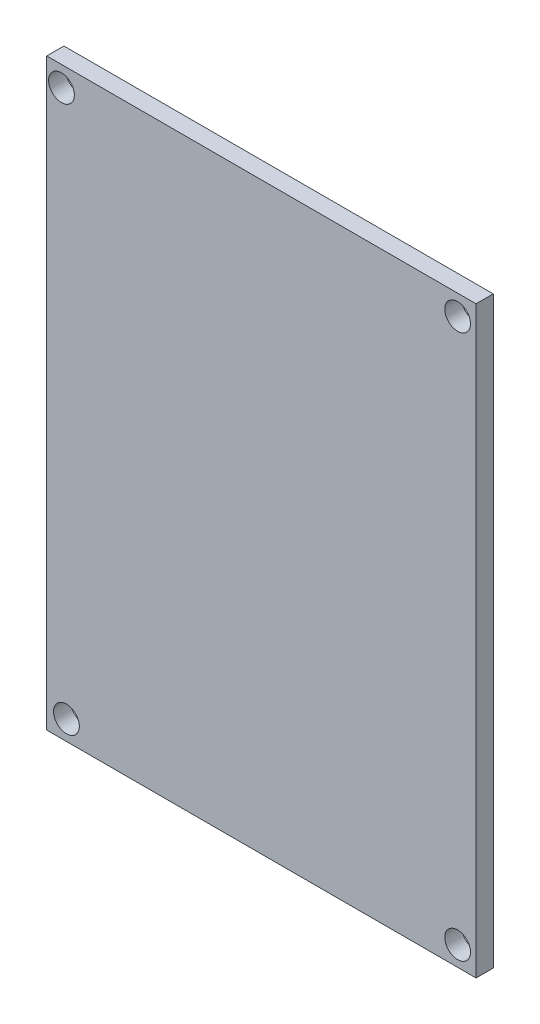
ISO-10303-21;
HEADER;
FILE_DESCRIPTION(('STEP AP214'),'2;1');
FILE_NAME('part.step','',(''),(''),'','','');
FILE_SCHEMA(('AUTOMOTIVE_DESIGN { 1 0 10303 214 1 1 1 1 }'));
ENDSEC;
DATA;
#1=APPLICATION_CONTEXT('core data for automotive mechanical design processes');
#2=APPLICATION_PROTOCOL_DEFINITION('international standard','automotive_design',2000,#1);
#3=PRODUCT_CONTEXT('',#1,'mechanical');
#4=PRODUCT('Part','Part','',(#3));
#5=PRODUCT_RELATED_PRODUCT_CATEGORY('part','',(#4));
#6=PRODUCT_DEFINITION_FORMATION('','',#4);
#7=PRODUCT_DEFINITION_CONTEXT('part definition',#1,'design');
#8=PRODUCT_DEFINITION('design','',#6,#7);
#9=PRODUCT_DEFINITION_SHAPE('','',#8);
#10=(LENGTH_UNIT() NAMED_UNIT(*) SI_UNIT(.MILLI.,.METRE.));
#11=(NAMED_UNIT(*) PLANE_ANGLE_UNIT() SI_UNIT($,.RADIAN.));
#12=(NAMED_UNIT(*) SI_UNIT($,.STERADIAN.) SOLID_ANGLE_UNIT());
#13=UNCERTAINTY_MEASURE_WITH_UNIT(LENGTH_MEASURE(1.E-05),#10,'distance_accuracy_value','');
#14=(GEOMETRIC_REPRESENTATION_CONTEXT(3) GLOBAL_UNCERTAINTY_ASSIGNED_CONTEXT((#13)) GLOBAL_UNIT_ASSIGNED_CONTEXT((#10,
#11,#12)) REPRESENTATION_CONTEXT('',''));
#15=CARTESIAN_POINT('',(0.,0.,0.));
#16=DIRECTION('',(0.,0.,1.));
#17=DIRECTION('',(1.,0.,0.));
#18=AXIS2_PLACEMENT_3D('',#15,#16,#17);
#19=CARTESIAN_POINT('',(-25.,34.,2.));
#20=DIRECTION('',(1.,0.,0.));
#21=DIRECTION('',(0.,1.,0.));
#22=AXIS2_PLACEMENT_3D('',#19,#20,#21);
#23=PLANE('',#22);
#24=DIRECTION('',(0.,-1.,0.));
#25=VECTOR('',#24,1.);
#26=CARTESIAN_POINT('',(-25.,34.,0.));
#27=LINE('',#26,#25);
#28=CARTESIAN_POINT('',(-25.,34.,0.));
#29=VERTEX_POINT('',#28);
#30=CARTESIAN_POINT('',(-25.,-34.,0.));
#31=VERTEX_POINT('',#30);
#32=EDGE_CURVE('E96',#29,#31,#27,.T.);
#33=ORIENTED_EDGE('',*,*,#32,.T.);
#34=DIRECTION('',(0.,0.,-1.));
#35=VECTOR('',#34,1.);
#36=CARTESIAN_POINT('',(-25.,-34.,2.));
#37=LINE('',#36,#35);
#38=CARTESIAN_POINT('',(-25.,-34.,2.));
#39=VERTEX_POINT('',#38);
#40=EDGE_CURVE('E11',#39,#31,#37,.T.);
#41=ORIENTED_EDGE('',*,*,#40,.F.);
#42=DIRECTION('',(0.,-1.,0.));
#43=VECTOR('',#42,1.);
#44=CARTESIAN_POINT('',(-25.,34.,2.));
#45=LINE('',#44,#43);
#46=CARTESIAN_POINT('',(-25.,34.,2.));
#47=VERTEX_POINT('',#46);
#48=EDGE_CURVE('E84',#47,#39,#45,.T.);
#49=ORIENTED_EDGE('',*,*,#48,.F.);
#50=DIRECTION('',(0.,0.,-1.));
#51=VECTOR('',#50,1.);
#52=CARTESIAN_POINT('',(-25.,34.,2.));
#53=LINE('',#52,#51);
#54=EDGE_CURVE('E92',#47,#29,#53,.T.);
#55=ORIENTED_EDGE('',*,*,#54,.T.);
#56=EDGE_LOOP('',(#33,#41,#49,#55));
#57=FACE_BOUND('',#56,.T.);
#58=ADVANCED_FACE('F33',(#57),#23,.F.);
#59=CARTESIAN_POINT('',(25.,-34.,2.));
#60=DIRECTION('',(0.,1.,0.));
#61=DIRECTION('',(-1.,0.,0.));
#62=AXIS2_PLACEMENT_3D('',#59,#60,#61);
#63=PLANE('',#62);
#64=DIRECTION('',(1.,0.,0.));
#65=VECTOR('',#64,1.);
#66=CARTESIAN_POINT('',(25.,-34.,0.));
#67=LINE('',#66,#65);
#68=CARTESIAN_POINT('',(25.,-34.,0.));
#69=VERTEX_POINT('',#68);
#70=EDGE_CURVE('E88',#31,#69,#67,.T.);
#71=ORIENTED_EDGE('',*,*,#70,.T.);
#72=DIRECTION('',(0.,0.,-1.));
#73=VECTOR('',#72,1.);
#74=CARTESIAN_POINT('',(25.,-34.,2.));
#75=LINE('',#74,#73);
#76=CARTESIAN_POINT('',(25.,-34.,2.));
#77=VERTEX_POINT('',#76);
#78=EDGE_CURVE('E41',#77,#69,#75,.T.);
#79=ORIENTED_EDGE('',*,*,#78,.F.);
#80=DIRECTION('',(1.,0.,0.));
#81=VECTOR('',#80,1.);
#82=CARTESIAN_POINT('',(25.,-34.,2.));
#83=LINE('',#82,#81);
#84=EDGE_CURVE('E79',#39,#77,#83,.T.);
#85=ORIENTED_EDGE('',*,*,#84,.F.);
#86=ORIENTED_EDGE('',*,*,#40,.T.);
#87=EDGE_LOOP('',(#71,#79,#85,#86));
#88=FACE_BOUND('',#87,.T.);
#89=ADVANCED_FACE('F87',(#88),#63,.F.);
#90=CARTESIAN_POINT('',(25.,34.,2.));
#91=DIRECTION('',(-1.,0.,0.));
#92=DIRECTION('',(0.,-1.,0.));
#93=AXIS2_PLACEMENT_3D('',#90,#91,#92);
#94=PLANE('',#93);
#95=DIRECTION('',(0.,1.,0.));
#96=VECTOR('',#95,1.);
#97=CARTESIAN_POINT('',(25.,34.,0.));
#98=LINE('',#97,#96);
#99=CARTESIAN_POINT('',(25.,34.,0.));
#100=VERTEX_POINT('',#99);
#101=EDGE_CURVE('E66',#69,#100,#98,.T.);
#102=ORIENTED_EDGE('',*,*,#101,.T.);
#103=DIRECTION('',(0.,0.,-1.));
#104=VECTOR('',#103,1.);
#105=CARTESIAN_POINT('',(25.,34.,2.));
#106=LINE('',#105,#104);
#107=CARTESIAN_POINT('',(25.,34.,2.));
#108=VERTEX_POINT('',#107);
#109=EDGE_CURVE('E89',#108,#100,#106,.T.);
#110=ORIENTED_EDGE('',*,*,#109,.F.);
#111=DIRECTION('',(0.,1.,0.));
#112=VECTOR('',#111,1.);
#113=CARTESIAN_POINT('',(25.,34.,2.));
#114=LINE('',#113,#112);
#115=EDGE_CURVE('E82',#77,#108,#114,.T.);
#116=ORIENTED_EDGE('',*,*,#115,.F.);
#117=ORIENTED_EDGE('',*,*,#78,.T.);
#118=EDGE_LOOP('',(#102,#110,#116,#117));
#119=FACE_BOUND('',#118,.T.);
#120=ADVANCED_FACE('F90',(#119),#94,.F.);
#121=CARTESIAN_POINT('',(25.,34.,2.));
#122=DIRECTION('',(0.,-1.,0.));
#123=DIRECTION('',(1.,0.,0.));
#124=AXIS2_PLACEMENT_3D('',#121,#122,#123);
#125=PLANE('',#124);
#126=DIRECTION('',(-1.,0.,0.));
#127=VECTOR('',#126,1.);
#128=CARTESIAN_POINT('',(25.,34.,0.));
#129=LINE('',#128,#127);
#130=EDGE_CURVE('E72',#100,#29,#129,.T.);
#131=ORIENTED_EDGE('',*,*,#130,.T.);
#132=ORIENTED_EDGE('',*,*,#54,.F.);
#133=DIRECTION('',(-1.,0.,0.));
#134=VECTOR('',#133,1.);
#135=CARTESIAN_POINT('',(25.,34.,2.));
#136=LINE('',#135,#134);
#137=EDGE_CURVE('E49',#108,#47,#136,.T.);
#138=ORIENTED_EDGE('',*,*,#137,.F.);
#139=ORIENTED_EDGE('',*,*,#109,.T.);
#140=EDGE_LOOP('',(#131,#132,#138,#139));
#141=FACE_BOUND('',#140,.T.);
#142=ADVANCED_FACE('F104',(#141),#125,.F.);
#143=CARTESIAN_POINT('',(0.,0.,2.));
#144=DIRECTION('',(0.,0.,-1.));
#145=DIRECTION('',(-1.,0.,0.));
#146=AXIS2_PLACEMENT_3D('',#143,#144,#145);
#147=PLANE('',#146);
#148=CARTESIAN_POINT('',(-22.706370595126,-31.7237330802718,2.));
#149=DIRECTION('',(0.,0.,-1.));
#150=DIRECTION('',(-1.,0.,0.));
#151=AXIS2_PLACEMENT_3D('',#148,#149,#150);
#152=CIRCLE('',#151,1.5);
#153=CARTESIAN_POINT('',(-24.206370595126,-31.7237330802718,2.));
#154=VERTEX_POINT('',#153);
#155=EDGE_CURVE('E119',#154,#154,#152,.T.);
#156=ORIENTED_EDGE('',*,*,#155,.T.);
#157=EDGE_LOOP('',(#156));
#158=FACE_BOUND('',#157,.T.);
#159=CARTESIAN_POINT('',(22.851227823803,-31.7237330802718,2.));
#160=DIRECTION('',(0.,0.,-1.));
#161=DIRECTION('',(-1.,0.,0.));
#162=AXIS2_PLACEMENT_3D('',#159,#160,#161);
#163=CIRCLE('',#162,1.5);
#164=CARTESIAN_POINT('',(21.351227823803,-31.7237330802718,2.));
#165=VERTEX_POINT('',#164);
#166=EDGE_CURVE('E125',#165,#165,#163,.T.);
#167=ORIENTED_EDGE('',*,*,#166,.T.);
#168=EDGE_LOOP('',(#167));
#169=FACE_BOUND('',#168,.T.);
#170=CARTESIAN_POINT('',(22.851227823803,31.6513044659332,2.));
#171=DIRECTION('',(0.,0.,-1.));
#172=DIRECTION('',(-1.,0.,0.));
#173=AXIS2_PLACEMENT_3D('',#170,#171,#172);
#174=CIRCLE('',#173,1.5);
#175=CARTESIAN_POINT('',(21.351227823803,31.6513044659332,2.));
#176=VERTEX_POINT('',#175);
#177=EDGE_CURVE('E113',#176,#176,#174,.T.);
#178=ORIENTED_EDGE('',*,*,#177,.T.);
#179=EDGE_LOOP('',(#178));
#180=FACE_BOUND('',#179,.T.);
#181=CARTESIAN_POINT('',(-23.2857995098344,31.6513044659332,2.));
#182=DIRECTION('',(0.,0.,-1.));
#183=DIRECTION('',(-1.,0.,0.));
#184=AXIS2_PLACEMENT_3D('',#181,#182,#183);
#185=CIRCLE('',#184,1.5);
#186=CARTESIAN_POINT('',(-24.7857995098344,31.6513044659332,2.));
#187=VERTEX_POINT('',#186);
#188=EDGE_CURVE('E99',#187,#187,#185,.T.);
#189=ORIENTED_EDGE('',*,*,#188,.T.);
#190=EDGE_LOOP('',(#189));
#191=FACE_BOUND('',#190,.T.);
#192=ORIENTED_EDGE('',*,*,#48,.T.);
#193=ORIENTED_EDGE('',*,*,#84,.T.);
#194=ORIENTED_EDGE('',*,*,#115,.T.);
#195=ORIENTED_EDGE('',*,*,#137,.T.);
#196=EDGE_LOOP('',(#192,#193,#194,#195));
#197=FACE_BOUND('',#196,.T.);
#198=ADVANCED_FACE('F80',(#158,#169,#180,#191,#197),#147,.F.);
#199=CARTESIAN_POINT('',(0.,0.,0.));
#200=DIRECTION('',(0.,0.,-1.));
#201=DIRECTION('',(-1.,0.,0.));
#202=AXIS2_PLACEMENT_3D('',#199,#200,#201);
#203=PLANE('',#202);
#204=CARTESIAN_POINT('',(-22.706370595126,-31.7237330802718,0.));
#205=DIRECTION('',(0.,0.,-1.));
#206=DIRECTION('',(-1.,0.,0.));
#207=AXIS2_PLACEMENT_3D('',#204,#205,#206);
#208=CIRCLE('',#207,1.5);
#209=CARTESIAN_POINT('',(-24.206370595126,-31.7237330802718,0.));
#210=VERTEX_POINT('',#209);
#211=EDGE_CURVE('E116',#210,#210,#208,.T.);
#212=ORIENTED_EDGE('',*,*,#211,.F.);
#213=EDGE_LOOP('',(#212));
#214=FACE_BOUND('',#213,.T.);
#215=CARTESIAN_POINT('',(22.851227823803,-31.7237330802718,0.));
#216=DIRECTION('',(0.,0.,-1.));
#217=DIRECTION('',(-1.,0.,0.));
#218=AXIS2_PLACEMENT_3D('',#215,#216,#217);
#219=CIRCLE('',#218,1.5);
#220=CARTESIAN_POINT('',(21.351227823803,-31.7237330802718,0.));
#221=VERTEX_POINT('',#220);
#222=EDGE_CURVE('E122',#221,#221,#219,.T.);
#223=ORIENTED_EDGE('',*,*,#222,.F.);
#224=EDGE_LOOP('',(#223));
#225=FACE_BOUND('',#224,.T.);
#226=CARTESIAN_POINT('',(22.851227823803,31.6513044659332,0.));
#227=DIRECTION('',(0.,0.,-1.));
#228=DIRECTION('',(-1.,0.,0.));
#229=AXIS2_PLACEMENT_3D('',#226,#227,#228);
#230=CIRCLE('',#229,1.5);
#231=CARTESIAN_POINT('',(21.351227823803,31.6513044659332,0.));
#232=VERTEX_POINT('',#231);
#233=EDGE_CURVE('E128',#232,#232,#230,.T.);
#234=ORIENTED_EDGE('',*,*,#233,.F.);
#235=EDGE_LOOP('',(#234));
#236=FACE_BOUND('',#235,.T.);
#237=CARTESIAN_POINT('',(-23.2857995098344,31.6513044659332,0.));
#238=DIRECTION('',(0.,0.,-1.));
#239=DIRECTION('',(-1.,0.,0.));
#240=AXIS2_PLACEMENT_3D('',#237,#238,#239);
#241=CIRCLE('',#240,1.5);
#242=CARTESIAN_POINT('',(-24.7857995098344,31.6513044659332,0.));
#243=VERTEX_POINT('',#242);
#244=EDGE_CURVE('E110',#243,#243,#241,.T.);
#245=ORIENTED_EDGE('',*,*,#244,.F.);
#246=EDGE_LOOP('',(#245));
#247=FACE_BOUND('',#246,.T.);
#248=ORIENTED_EDGE('',*,*,#32,.F.);
#249=ORIENTED_EDGE('',*,*,#130,.F.);
#250=ORIENTED_EDGE('',*,*,#101,.F.);
#251=ORIENTED_EDGE('',*,*,#70,.F.);
#252=EDGE_LOOP('',(#248,#249,#250,#251));
#253=FACE_BOUND('',#252,.T.);
#254=ADVANCED_FACE('F107',(#214,#225,#236,#247,#253),#203,.T.);
#255=CARTESIAN_POINT('',(-23.2857995098344,31.6513044659332,2.));
#256=DIRECTION('',(0.,0.,-1.));
#257=DIRECTION('',(-1.,0.,0.));
#258=AXIS2_PLACEMENT_3D('',#255,#256,#257);
#259=CYLINDRICAL_SURFACE('',#258,1.5);
#260=ORIENTED_EDGE('',*,*,#188,.F.);
#261=EDGE_LOOP('',(#260));
#262=FACE_BOUND('',#261,.T.);
#263=ORIENTED_EDGE('',*,*,#244,.T.);
#264=EDGE_LOOP('',(#263));
#265=FACE_BOUND('',#264,.T.);
#266=ADVANCED_FACE('F140',(#262,#265),#259,.F.);
#267=CARTESIAN_POINT('',(22.851227823803,31.6513044659332,2.));
#268=DIRECTION('',(0.,0.,-1.));
#269=DIRECTION('',(-1.,0.,0.));
#270=AXIS2_PLACEMENT_3D('',#267,#268,#269);
#271=CYLINDRICAL_SURFACE('',#270,1.5);
#272=ORIENTED_EDGE('',*,*,#177,.F.);
#273=EDGE_LOOP('',(#272));
#274=FACE_BOUND('',#273,.T.);
#275=ORIENTED_EDGE('',*,*,#233,.T.);
#276=EDGE_LOOP('',(#275));
#277=FACE_BOUND('',#276,.T.);
#278=ADVANCED_FACE('F136',(#274,#277),#271,.F.);
#279=CARTESIAN_POINT('',(22.851227823803,-31.7237330802718,2.));
#280=DIRECTION('',(0.,0.,-1.));
#281=DIRECTION('',(-1.,0.,0.));
#282=AXIS2_PLACEMENT_3D('',#279,#280,#281);
#283=CYLINDRICAL_SURFACE('',#282,1.5);
#284=ORIENTED_EDGE('',*,*,#166,.F.);
#285=EDGE_LOOP('',(#284));
#286=FACE_BOUND('',#285,.T.);
#287=ORIENTED_EDGE('',*,*,#222,.T.);
#288=EDGE_LOOP('',(#287));
#289=FACE_BOUND('',#288,.T.);
#290=ADVANCED_FACE('F139',(#286,#289),#283,.F.);
#291=CARTESIAN_POINT('',(-22.706370595126,-31.7237330802718,2.));
#292=DIRECTION('',(0.,0.,-1.));
#293=DIRECTION('',(-1.,0.,0.));
#294=AXIS2_PLACEMENT_3D('',#291,#292,#293);
#295=CYLINDRICAL_SURFACE('',#294,1.5);
#296=ORIENTED_EDGE('',*,*,#155,.F.);
#297=EDGE_LOOP('',(#296));
#298=FACE_BOUND('',#297,.T.);
#299=ORIENTED_EDGE('',*,*,#211,.T.);
#300=EDGE_LOOP('',(#299));
#301=FACE_BOUND('',#300,.T.);
#302=ADVANCED_FACE('F178',(#298,#301),#295,.F.);
#303=CLOSED_SHELL('',(#58,#89,#120,#142,#198,#254,#266,#278,#290,#302));
#304=MANIFOLD_SOLID_BREP('B2',#303);
#305=ADVANCED_BREP_SHAPE_REPRESENTATION('',(#18,#304),#14);
#306=SHAPE_DEFINITION_REPRESENTATION(#9,#305);
ENDSEC;
END-ISO-10303-21;
